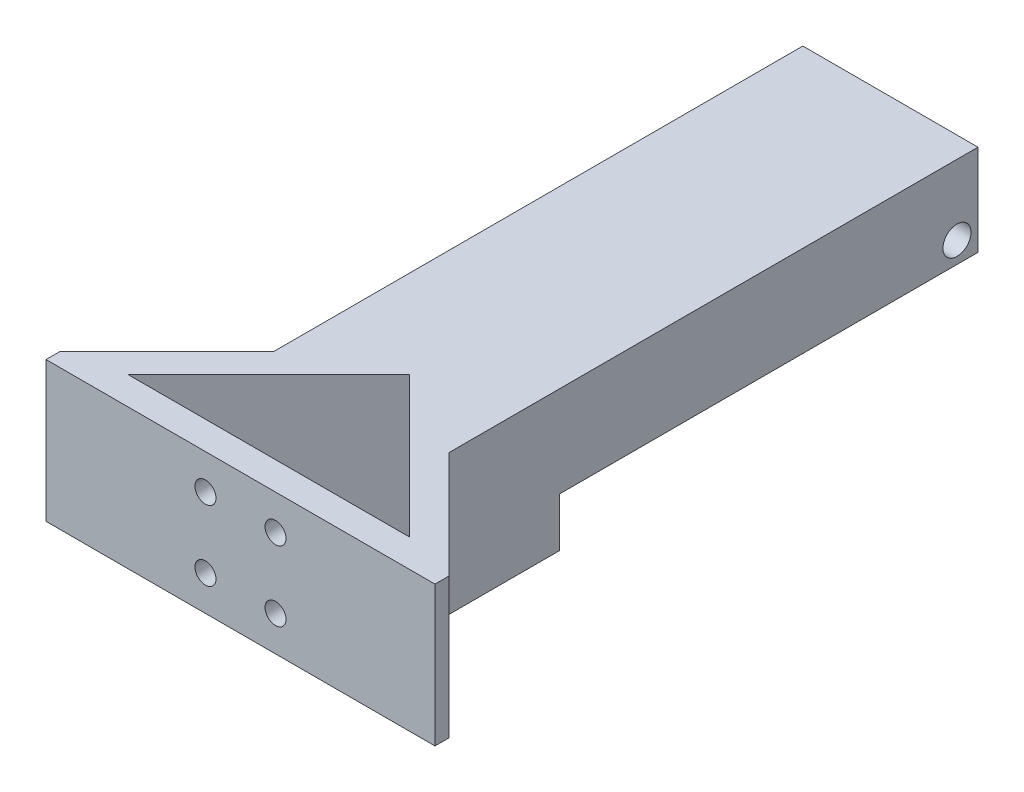
ISO-10303-21;
HEADER;
FILE_DESCRIPTION(('STEP AP214'),'2;1');
FILE_NAME('part.step','',(''),(''),'','','');
FILE_SCHEMA(('AUTOMOTIVE_DESIGN { 1 0 10303 214 1 1 1 1 }'));
ENDSEC;
DATA;
#1=APPLICATION_CONTEXT('core data for automotive mechanical design processes');
#2=APPLICATION_PROTOCOL_DEFINITION('international standard','automotive_design',2000,#1);
#3=PRODUCT_CONTEXT('',#1,'mechanical');
#4=PRODUCT('Part','Part','',(#3));
#5=PRODUCT_RELATED_PRODUCT_CATEGORY('part','',(#4));
#6=PRODUCT_DEFINITION_FORMATION('','',#4);
#7=PRODUCT_DEFINITION_CONTEXT('part definition',#1,'design');
#8=PRODUCT_DEFINITION('design','',#6,#7);
#9=PRODUCT_DEFINITION_SHAPE('','',#8);
#10=(LENGTH_UNIT() NAMED_UNIT(*) SI_UNIT(.MILLI.,.METRE.));
#11=(NAMED_UNIT(*) PLANE_ANGLE_UNIT() SI_UNIT($,.RADIAN.));
#12=(NAMED_UNIT(*) SI_UNIT($,.STERADIAN.) SOLID_ANGLE_UNIT());
#13=UNCERTAINTY_MEASURE_WITH_UNIT(LENGTH_MEASURE(1.E-05),#10,'distance_accuracy_value','');
#14=(GEOMETRIC_REPRESENTATION_CONTEXT(3) GLOBAL_UNCERTAINTY_ASSIGNED_CONTEXT((#13)) GLOBAL_UNIT_ASSIGNED_CONTEXT((#10,
#11,#12)) REPRESENTATION_CONTEXT('',''));
#15=CARTESIAN_POINT('',(0.,0.,0.));
#16=DIRECTION('',(0.,0.,1.));
#17=DIRECTION('',(1.,0.,0.));
#18=AXIS2_PLACEMENT_3D('',#15,#16,#17);
#19=CARTESIAN_POINT('',(40.2477067298061,20.,-92.7322932701938));
#20=DIRECTION('',(0.,0.,1.));
#21=DIRECTION('',(1.,0.,0.));
#22=AXIS2_PLACEMENT_3D('',#19,#20,#21);
#23=PLANE('',#22);
#24=DIRECTION('',(1.,0.,0.));
#25=VECTOR('',#24,1.);
#26=CARTESIAN_POINT('',(40.2477067298061,7.,-92.7322932701938));
#27=LINE('',#26,#25);
#28=CARTESIAN_POINT('',(15.2522932701938,7.,-92.7322932701938));
#29=VERTEX_POINT('',#28);
#30=CARTESIAN_POINT('',(40.2477067298061,7.,-92.7322932701938));
#31=VERTEX_POINT('',#30);
#32=EDGE_CURVE('E130',#29,#31,#27,.T.);
#33=ORIENTED_EDGE('',*,*,#32,.F.);
#34=DIRECTION('',(0.,-1.,0.));
#35=VECTOR('',#34,1.);
#36=CARTESIAN_POINT('',(15.2522932701938,20.,-92.7322932701938));
#37=LINE('',#36,#35);
#38=CARTESIAN_POINT('',(15.2522932701938,20.,-92.7322932701938));
#39=VERTEX_POINT('',#38);
#40=EDGE_CURVE('E228',#39,#29,#37,.T.);
#41=ORIENTED_EDGE('',*,*,#40,.F.);
#42=DIRECTION('',(-1.,0.,0.));
#43=VECTOR('',#42,1.);
#44=CARTESIAN_POINT('',(40.2477067298061,20.,-92.7322932701938));
#45=LINE('',#44,#43);
#46=CARTESIAN_POINT('',(40.2477067298061,20.,-92.7322932701938));
#47=VERTEX_POINT('',#46);
#48=EDGE_CURVE('E199',#47,#39,#45,.T.);
#49=ORIENTED_EDGE('',*,*,#48,.F.);
#50=DIRECTION('',(0.,-1.,0.));
#51=VECTOR('',#50,1.);
#52=CARTESIAN_POINT('',(40.2477067298061,20.,-92.7322932701938));
#53=LINE('',#52,#51);
#54=EDGE_CURVE('E231',#47,#31,#53,.T.);
#55=ORIENTED_EDGE('',*,*,#54,.T.);
#56=EDGE_LOOP('',(#33,#41,#49,#55));
#57=FACE_BOUND('',#56,.T.);
#58=ADVANCED_FACE('F32',(#57),#23,.F.);
#59=CARTESIAN_POINT('',(0.,20.,0.));
#60=DIRECTION('',(0.,1.,0.));
#61=DIRECTION('',(0.,0.,1.));
#62=AXIS2_PLACEMENT_3D('',#59,#60,#61);
#63=PLANE('',#62);
#64=DIRECTION('',(1.,0.,0.));
#65=VECTOR('',#64,1.);
#66=CARTESIAN_POINT('',(55.5,20.,0.));
#67=LINE('',#66,#65);
#68=CARTESIAN_POINT('',(0.,20.,0.));
#69=VERTEX_POINT('',#68);
#70=CARTESIAN_POINT('',(55.5,20.,0.));
#71=VERTEX_POINT('',#70);
#72=EDGE_CURVE('E189',#69,#71,#67,.T.);
#73=ORIENTED_EDGE('',*,*,#72,.T.);
#74=DIRECTION('',(0.,0.,-1.));
#75=VECTOR('',#74,1.);
#76=CARTESIAN_POINT('',(55.5,20.,-2.));
#77=LINE('',#76,#75);
#78=CARTESIAN_POINT('',(55.5,20.,-2.));
#79=VERTEX_POINT('',#78);
#80=EDGE_CURVE('E192',#71,#79,#77,.T.);
#81=ORIENTED_EDGE('',*,*,#80,.T.);
#82=DIRECTION('',(-0.707106781186547,0.,-0.707106781186548));
#83=VECTOR('',#82,1.);
#84=CARTESIAN_POINT('',(40.2477067298062,20.,-17.2522932701938));
#85=LINE('',#84,#83);
#86=CARTESIAN_POINT('',(40.2477067298062,20.,-17.2522932701938));
#87=VERTEX_POINT('',#86);
#88=EDGE_CURVE('E195',#79,#87,#85,.T.);
#89=ORIENTED_EDGE('',*,*,#88,.T.);
#90=DIRECTION('',(0.,0.,-1.));
#91=VECTOR('',#90,1.);
#92=CARTESIAN_POINT('',(40.2477067298061,20.,-92.7322932701938));
#93=LINE('',#92,#91);
#94=EDGE_CURVE('E197',#87,#47,#93,.T.);
#95=ORIENTED_EDGE('',*,*,#94,.T.);
#96=ORIENTED_EDGE('',*,*,#48,.T.);
#97=DIRECTION('',(0.,0.,1.));
#98=VECTOR('',#97,1.);
#99=CARTESIAN_POINT('',(15.2522932701938,20.,-92.7322932701938));
#100=LINE('',#99,#98);
#101=CARTESIAN_POINT('',(15.2522932701938,20.,-17.2522932701938));
#102=VERTEX_POINT('',#101);
#103=EDGE_CURVE('E201',#39,#102,#100,.T.);
#104=ORIENTED_EDGE('',*,*,#103,.T.);
#105=DIRECTION('',(-0.707106781186547,0.,0.707106781186548));
#106=VECTOR('',#105,1.);
#107=CARTESIAN_POINT('',(15.2522932701938,20.,-17.2522932701938));
#108=LINE('',#107,#106);
#109=CARTESIAN_POINT('',(0.,20.,-2.));
#110=VERTEX_POINT('',#109);
#111=EDGE_CURVE('E203',#102,#110,#108,.T.);
#112=ORIENTED_EDGE('',*,*,#111,.T.);
#113=DIRECTION('',(0.,0.,1.));
#114=VECTOR('',#113,1.);
#115=CARTESIAN_POINT('',(0.,20.,-2.));
#116=LINE('',#115,#114);
#117=EDGE_CURVE('E205',#110,#69,#116,.T.);
#118=ORIENTED_EDGE('',*,*,#117,.T.);
#119=EDGE_LOOP('',(#73,#81,#89,#95,#96,#104,#112,#118));
#120=FACE_BOUND('',#119,.T.);
#121=DIRECTION('',(1.,0.,0.));
#122=VECTOR('',#121,1.);
#123=CARTESIAN_POINT('',(47.8431457505076,20.,-4.));
#124=LINE('',#123,#122);
#125=CARTESIAN_POINT('',(7.65685424949238,20.,-3.99999999999999));
#126=VERTEX_POINT('',#125);
#127=CARTESIAN_POINT('',(47.8431457505076,20.,-4.));
#128=VERTEX_POINT('',#127);
#129=EDGE_CURVE('E168',#126,#128,#124,.T.);
#130=ORIENTED_EDGE('',*,*,#129,.F.);
#131=DIRECTION('',(-0.707106781186547,0.,0.707106781186548));
#132=VECTOR('',#131,1.);
#133=CARTESIAN_POINT('',(7.65685424949238,20.,-3.99999999999999));
#134=LINE('',#133,#132);
#135=CARTESIAN_POINT('',(27.75,20.,-24.0931457505076));
#136=VERTEX_POINT('',#135);
#137=EDGE_CURVE('E166',#136,#126,#134,.T.);
#138=ORIENTED_EDGE('',*,*,#137,.F.);
#139=DIRECTION('',(-0.707106781186547,0.,-0.707106781186548));
#140=VECTOR('',#139,1.);
#141=CARTESIAN_POINT('',(27.75,20.,-24.0931457505076));
#142=LINE('',#141,#140);
#143=EDGE_CURVE('E171',#128,#136,#142,.T.);
#144=ORIENTED_EDGE('',*,*,#143,.F.);
#145=EDGE_LOOP('',(#130,#138,#144));
#146=FACE_BOUND('',#145,.T.);
#147=ADVANCED_FACE('F257',(#120,#146),#63,.T.);
#148=CARTESIAN_POINT('',(0.,0.,0.));
#149=DIRECTION('',(0.,1.,0.));
#150=DIRECTION('',(0.,0.,1.));
#151=AXIS2_PLACEMENT_3D('',#148,#149,#150);
#152=PLANE('',#151);
#153=DIRECTION('',(0.,0.,1.));
#154=VECTOR('',#153,1.);
#155=CARTESIAN_POINT('',(15.2522932701938,0.,-92.7322932701938));
#156=LINE('',#155,#154);
#157=CARTESIAN_POINT('',(15.2522932701938,0.,-33.0022932701938));
#158=VERTEX_POINT('',#157);
#159=CARTESIAN_POINT('',(15.2522932701938,0.,-17.2522932701938));
#160=VERTEX_POINT('',#159);
#161=EDGE_CURVE('E215',#158,#160,#156,.T.);
#162=ORIENTED_EDGE('',*,*,#161,.F.);
#163=DIRECTION('',(-1.,0.,0.));
#164=VECTOR('',#163,1.);
#165=CARTESIAN_POINT('',(40.2477067298061,0.,-33.0022932701938));
#166=LINE('',#165,#164);
#167=CARTESIAN_POINT('',(40.2477067298061,0.,-33.0022932701938));
#168=VERTEX_POINT('',#167);
#169=EDGE_CURVE('E139',#168,#158,#166,.T.);
#170=ORIENTED_EDGE('',*,*,#169,.F.);
#171=DIRECTION('',(0.,0.,-1.));
#172=VECTOR('',#171,1.);
#173=CARTESIAN_POINT('',(40.2477067298061,0.,-92.7322932701938));
#174=LINE('',#173,#172);
#175=CARTESIAN_POINT('',(40.2477067298062,0.,-17.2522932701938));
#176=VERTEX_POINT('',#175);
#177=EDGE_CURVE('E145',#176,#168,#174,.T.);
#178=ORIENTED_EDGE('',*,*,#177,.F.);
#179=DIRECTION('',(-0.707106781186547,0.,-0.707106781186548));
#180=VECTOR('',#179,1.);
#181=CARTESIAN_POINT('',(40.2477067298062,0.,-17.2522932701938));
#182=LINE('',#181,#180);
#183=CARTESIAN_POINT('',(55.5,0.,-2.));
#184=VERTEX_POINT('',#183);
#185=EDGE_CURVE('E212',#184,#176,#182,.T.);
#186=ORIENTED_EDGE('',*,*,#185,.F.);
#187=DIRECTION('',(0.,0.,-1.));
#188=VECTOR('',#187,1.);
#189=CARTESIAN_POINT('',(55.5,0.,-2.));
#190=LINE('',#189,#188);
#191=CARTESIAN_POINT('',(55.5,0.,0.));
#192=VERTEX_POINT('',#191);
#193=EDGE_CURVE('E210',#192,#184,#190,.T.);
#194=ORIENTED_EDGE('',*,*,#193,.F.);
#195=DIRECTION('',(1.,0.,0.));
#196=VECTOR('',#195,1.);
#197=CARTESIAN_POINT('',(55.5,0.,0.));
#198=LINE('',#197,#196);
#199=CARTESIAN_POINT('',(0.,0.,0.));
#200=VERTEX_POINT('',#199);
#201=EDGE_CURVE('E188',#200,#192,#198,.T.);
#202=ORIENTED_EDGE('',*,*,#201,.F.);
#203=DIRECTION('',(0.,0.,1.));
#204=VECTOR('',#203,1.);
#205=CARTESIAN_POINT('',(0.,0.,-2.));
#206=LINE('',#205,#204);
#207=CARTESIAN_POINT('',(0.,0.,-2.));
#208=VERTEX_POINT('',#207);
#209=EDGE_CURVE('E193',#208,#200,#206,.T.);
#210=ORIENTED_EDGE('',*,*,#209,.F.);
#211=DIRECTION('',(-0.707106781186547,0.,0.707106781186548));
#212=VECTOR('',#211,1.);
#213=CARTESIAN_POINT('',(15.2522932701938,0.,-17.2522932701938));
#214=LINE('',#213,#212);
#215=EDGE_CURVE('E217',#160,#208,#214,.T.);
#216=ORIENTED_EDGE('',*,*,#215,.F.);
#217=EDGE_LOOP('',(#162,#170,#178,#186,#194,#202,#210,#216));
#218=FACE_BOUND('',#217,.T.);
#219=DIRECTION('',(-0.707106781186547,0.,0.707106781186548));
#220=VECTOR('',#219,1.);
#221=CARTESIAN_POINT('',(7.65685424949238,0.,-3.99999999999999));
#222=LINE('',#221,#220);
#223=CARTESIAN_POINT('',(27.75,0.,-24.0931457505076));
#224=VERTEX_POINT('',#223);
#225=CARTESIAN_POINT('',(7.65685424949238,0.,-3.99999999999999));
#226=VERTEX_POINT('',#225);
#227=EDGE_CURVE('E174',#224,#226,#222,.T.);
#228=ORIENTED_EDGE('',*,*,#227,.T.);
#229=DIRECTION('',(1.,0.,0.));
#230=VECTOR('',#229,1.);
#231=CARTESIAN_POINT('',(47.8431457505076,0.,-4.));
#232=LINE('',#231,#230);
#233=CARTESIAN_POINT('',(47.8431457505076,0.,-4.));
#234=VERTEX_POINT('',#233);
#235=EDGE_CURVE('E177',#226,#234,#232,.T.);
#236=ORIENTED_EDGE('',*,*,#235,.T.);
#237=DIRECTION('',(-0.707106781186547,0.,-0.707106781186548));
#238=VECTOR('',#237,1.);
#239=CARTESIAN_POINT('',(27.75,0.,-24.0931457505076));
#240=LINE('',#239,#238);
#241=EDGE_CURVE('E169',#234,#224,#240,.T.);
#242=ORIENTED_EDGE('',*,*,#241,.T.);
#243=EDGE_LOOP('',(#228,#236,#242));
#244=FACE_BOUND('',#243,.T.);
#245=ADVANCED_FACE('F267',(#218,#244),#152,.F.);
#246=CARTESIAN_POINT('',(55.5,20.,0.));
#247=DIRECTION('',(0.,0.,-1.));
#248=DIRECTION('',(-1.,0.,0.));
#249=AXIS2_PLACEMENT_3D('',#246,#247,#248);
#250=PLANE('',#249);
#251=CARTESIAN_POINT('',(22.75,5.,0.));
#252=DIRECTION('',(0.,0.,1.));
#253=DIRECTION('',(-1.,0.,0.));
#254=AXIS2_PLACEMENT_3D('',#251,#252,#253);
#255=CIRCLE('',#254,1.5);
#256=CARTESIAN_POINT('',(21.25,5.,0.));
#257=VERTEX_POINT('',#256);
#258=EDGE_CURVE('E146',#257,#257,#255,.T.);
#259=ORIENTED_EDGE('',*,*,#258,.F.);
#260=EDGE_LOOP('',(#259));
#261=FACE_BOUND('',#260,.T.);
#262=CARTESIAN_POINT('',(32.75,5.,0.));
#263=DIRECTION('',(0.,0.,1.));
#264=DIRECTION('',(1.,0.,0.));
#265=AXIS2_PLACEMENT_3D('',#262,#263,#264);
#266=CIRCLE('',#265,1.5);
#267=CARTESIAN_POINT('',(34.25,5.,0.));
#268=VERTEX_POINT('',#267);
#269=EDGE_CURVE('E154',#268,#268,#266,.T.);
#270=ORIENTED_EDGE('',*,*,#269,.F.);
#271=EDGE_LOOP('',(#270));
#272=FACE_BOUND('',#271,.T.);
#273=CARTESIAN_POINT('',(32.75,15.,0.));
#274=DIRECTION('',(0.,0.,1.));
#275=DIRECTION('',(-1.,0.,0.));
#276=AXIS2_PLACEMENT_3D('',#273,#274,#275);
#277=CIRCLE('',#276,1.5);
#278=CARTESIAN_POINT('',(31.25,15.,0.));
#279=VERTEX_POINT('',#278);
#280=EDGE_CURVE('E158',#279,#279,#277,.T.);
#281=ORIENTED_EDGE('',*,*,#280,.F.);
#282=EDGE_LOOP('',(#281));
#283=FACE_BOUND('',#282,.T.);
#284=CARTESIAN_POINT('',(22.75,15.,0.));
#285=DIRECTION('',(0.,0.,1.));
#286=DIRECTION('',(1.,0.,0.));
#287=AXIS2_PLACEMENT_3D('',#284,#285,#286);
#288=CIRCLE('',#287,1.5);
#289=CARTESIAN_POINT('',(24.25,15.,0.));
#290=VERTEX_POINT('',#289);
#291=EDGE_CURVE('E162',#290,#290,#288,.T.);
#292=ORIENTED_EDGE('',*,*,#291,.F.);
#293=EDGE_LOOP('',(#292));
#294=FACE_BOUND('',#293,.T.);
#295=ORIENTED_EDGE('',*,*,#201,.T.);
#296=DIRECTION('',(0.,-1.,0.));
#297=VECTOR('',#296,1.);
#298=CARTESIAN_POINT('',(55.5,20.,0.));
#299=LINE('',#298,#297);
#300=EDGE_CURVE('E238',#71,#192,#299,.T.);
#301=ORIENTED_EDGE('',*,*,#300,.F.);
#302=ORIENTED_EDGE('',*,*,#72,.F.);
#303=DIRECTION('',(0.,-1.,0.));
#304=VECTOR('',#303,1.);
#305=CARTESIAN_POINT('',(0.,20.,0.));
#306=LINE('',#305,#304);
#307=EDGE_CURVE('E207',#69,#200,#306,.T.);
#308=ORIENTED_EDGE('',*,*,#307,.T.);
#309=EDGE_LOOP('',(#295,#301,#302,#308));
#310=FACE_BOUND('',#309,.T.);
#311=ADVANCED_FACE('F34',(#261,#272,#283,#294,#310),#250,.F.);
#312=CARTESIAN_POINT('',(55.5,20.,-2.));
#313=DIRECTION('',(-1.,0.,0.));
#314=DIRECTION('',(0.,0.,1.));
#315=AXIS2_PLACEMENT_3D('',#312,#313,#314);
#316=PLANE('',#315);
#317=ORIENTED_EDGE('',*,*,#193,.T.);
#318=DIRECTION('',(0.,-1.,0.));
#319=VECTOR('',#318,1.);
#320=CARTESIAN_POINT('',(55.5,20.,-2.));
#321=LINE('',#320,#319);
#322=EDGE_CURVE('E235',#79,#184,#321,.T.);
#323=ORIENTED_EDGE('',*,*,#322,.F.);
#324=ORIENTED_EDGE('',*,*,#80,.F.);
#325=ORIENTED_EDGE('',*,*,#300,.T.);
#326=EDGE_LOOP('',(#317,#323,#324,#325));
#327=FACE_BOUND('',#326,.T.);
#328=ADVANCED_FACE('F303',(#327),#316,.F.);
#329=CARTESIAN_POINT('',(40.2477067298062,20.,-17.2522932701938));
#330=DIRECTION('',(-0.707106781186548,0.,0.707106781186547));
#331=DIRECTION('',(0.707106781186547,0.,0.707106781186548));
#332=AXIS2_PLACEMENT_3D('',#329,#330,#331);
#333=PLANE('',#332);
#334=ORIENTED_EDGE('',*,*,#185,.T.);
#335=DIRECTION('',(0.,-1.,0.));
#336=VECTOR('',#335,1.);
#337=CARTESIAN_POINT('',(40.2477067298062,20.,-17.2522932701938));
#338=LINE('',#337,#336);
#339=EDGE_CURVE('E233',#87,#176,#338,.T.);
#340=ORIENTED_EDGE('',*,*,#339,.F.);
#341=ORIENTED_EDGE('',*,*,#88,.F.);
#342=ORIENTED_EDGE('',*,*,#322,.T.);
#343=EDGE_LOOP('',(#334,#340,#341,#342));
#344=FACE_BOUND('',#343,.T.);
#345=ADVANCED_FACE('F293',(#344),#333,.F.);
#346=CARTESIAN_POINT('',(40.2477067298061,20.,-92.7322932701938));
#347=DIRECTION('',(-1.,0.,0.));
#348=DIRECTION('',(0.,0.,1.));
#349=AXIS2_PLACEMENT_3D('',#346,#347,#348);
#350=PLANE('',#349);
#351=CARTESIAN_POINT('',(40.2477067298061,10.,-89.7322932701938));
#352=DIRECTION('',(-1.,0.,0.));
#353=DIRECTION('',(0.,0.,1.));
#354=AXIS2_PLACEMENT_3D('',#351,#352,#353);
#355=CIRCLE('',#354,2.);
#356=CARTESIAN_POINT('',(40.2477067298061,10.,-87.7322932701938));
#357=VERTEX_POINT('',#356);
#358=EDGE_CURVE('E270',#357,#357,#355,.T.);
#359=ORIENTED_EDGE('',*,*,#358,.T.);
#360=EDGE_LOOP('',(#359));
#361=FACE_BOUND('',#360,.T.);
#362=ORIENTED_EDGE('',*,*,#177,.T.);
#363=DIRECTION('',(0.,-1.,0.));
#364=VECTOR('',#363,1.);
#365=CARTESIAN_POINT('',(40.2477067298061,7.,-33.0022932701938));
#366=LINE('',#365,#364);
#367=CARTESIAN_POINT('',(40.2477067298061,7.,-33.0022932701938));
#368=VERTEX_POINT('',#367);
#369=EDGE_CURVE('E127',#368,#168,#366,.T.);
#370=ORIENTED_EDGE('',*,*,#369,.F.);
#371=DIRECTION('',(0.,0.,1.));
#372=VECTOR('',#371,1.);
#373=CARTESIAN_POINT('',(40.2477067298061,7.,-92.7322932701938));
#374=LINE('',#373,#372);
#375=EDGE_CURVE('E131',#31,#368,#374,.T.);
#376=ORIENTED_EDGE('',*,*,#375,.F.);
#377=ORIENTED_EDGE('',*,*,#54,.F.);
#378=ORIENTED_EDGE('',*,*,#94,.F.);
#379=ORIENTED_EDGE('',*,*,#339,.T.);
#380=EDGE_LOOP('',(#362,#370,#376,#377,#378,#379));
#381=FACE_BOUND('',#380,.T.);
#382=ADVANCED_FACE('F142',(#361,#381),#350,.F.);
#383=CARTESIAN_POINT('',(15.2522932701938,20.,-92.7322932701938));
#384=DIRECTION('',(1.,0.,0.));
#385=DIRECTION('',(0.,0.,-1.));
#386=AXIS2_PLACEMENT_3D('',#383,#384,#385);
#387=PLANE('',#386);
#388=CARTESIAN_POINT('',(15.2522932701938,10.,-89.7322932701938));
#389=DIRECTION('',(-1.,0.,0.));
#390=DIRECTION('',(0.,0.,1.));
#391=AXIS2_PLACEMENT_3D('',#388,#389,#390);
#392=CIRCLE('',#391,2.);
#393=CARTESIAN_POINT('',(15.2522932701938,10.,-87.7322932701938));
#394=VERTEX_POINT('',#393);
#395=EDGE_CURVE('E272',#394,#394,#392,.T.);
#396=ORIENTED_EDGE('',*,*,#395,.F.);
#397=EDGE_LOOP('',(#396));
#398=FACE_BOUND('',#397,.T.);
#399=DIRECTION('',(0.,0.,-1.));
#400=VECTOR('',#399,1.);
#401=CARTESIAN_POINT('',(15.2522932701938,7.,-92.7322932701938));
#402=LINE('',#401,#400);
#403=CARTESIAN_POINT('',(15.2522932701938,7.,-33.0022932701938));
#404=VERTEX_POINT('',#403);
#405=EDGE_CURVE('E40',#404,#29,#402,.T.);
#406=ORIENTED_EDGE('',*,*,#405,.F.);
#407=DIRECTION('',(0.,-1.,0.));
#408=VECTOR('',#407,1.);
#409=CARTESIAN_POINT('',(15.2522932701938,20.,-33.0022932701938));
#410=LINE('',#409,#408);
#411=EDGE_CURVE('E11',#404,#158,#410,.T.);
#412=ORIENTED_EDGE('',*,*,#411,.T.);
#413=ORIENTED_EDGE('',*,*,#161,.T.);
#414=DIRECTION('',(0.,-1.,0.));
#415=VECTOR('',#414,1.);
#416=CARTESIAN_POINT('',(15.2522932701938,20.,-17.2522932701938));
#417=LINE('',#416,#415);
#418=EDGE_CURVE('E225',#102,#160,#417,.T.);
#419=ORIENTED_EDGE('',*,*,#418,.F.);
#420=ORIENTED_EDGE('',*,*,#103,.F.);
#421=ORIENTED_EDGE('',*,*,#40,.T.);
#422=EDGE_LOOP('',(#406,#412,#413,#419,#420,#421));
#423=FACE_BOUND('',#422,.T.);
#424=ADVANCED_FACE('F253',(#398,#423),#387,.F.);
#425=CARTESIAN_POINT('',(15.2522932701938,20.,-17.2522932701938));
#426=DIRECTION('',(0.707106781186548,0.,0.707106781186547));
#427=DIRECTION('',(0.707106781186547,0.,-0.707106781186548));
#428=AXIS2_PLACEMENT_3D('',#425,#426,#427);
#429=PLANE('',#428);
#430=ORIENTED_EDGE('',*,*,#215,.T.);
#431=DIRECTION('',(0.,-1.,0.));
#432=VECTOR('',#431,1.);
#433=CARTESIAN_POINT('',(0.,20.,-2.));
#434=LINE('',#433,#432);
#435=EDGE_CURVE('E222',#110,#208,#434,.T.);
#436=ORIENTED_EDGE('',*,*,#435,.F.);
#437=ORIENTED_EDGE('',*,*,#111,.F.);
#438=ORIENTED_EDGE('',*,*,#418,.T.);
#439=EDGE_LOOP('',(#430,#436,#437,#438));
#440=FACE_BOUND('',#439,.T.);
#441=ADVANCED_FACE('F284',(#440),#429,.F.);
#442=CARTESIAN_POINT('',(0.,20.,-2.));
#443=DIRECTION('',(1.,0.,0.));
#444=DIRECTION('',(0.,0.,-1.));
#445=AXIS2_PLACEMENT_3D('',#442,#443,#444);
#446=PLANE('',#445);
#447=ORIENTED_EDGE('',*,*,#209,.T.);
#448=ORIENTED_EDGE('',*,*,#307,.F.);
#449=ORIENTED_EDGE('',*,*,#117,.F.);
#450=ORIENTED_EDGE('',*,*,#435,.T.);
#451=EDGE_LOOP('',(#447,#448,#449,#450));
#452=FACE_BOUND('',#451,.T.);
#453=ADVANCED_FACE('F290',(#452),#446,.F.);
#454=CARTESIAN_POINT('',(7.65685424949238,20.,-3.99999999999999));
#455=DIRECTION('',(0.707106781186548,0.,0.707106781186547));
#456=DIRECTION('',(0.707106781186547,0.,-0.707106781186548));
#457=AXIS2_PLACEMENT_3D('',#454,#455,#456);
#458=PLANE('',#457);
#459=ORIENTED_EDGE('',*,*,#227,.F.);
#460=DIRECTION('',(0.,-1.,0.));
#461=VECTOR('',#460,1.);
#462=CARTESIAN_POINT('',(27.75,20.,-24.0931457505076));
#463=LINE('',#462,#461);
#464=EDGE_CURVE('E173',#136,#224,#463,.T.);
#465=ORIENTED_EDGE('',*,*,#464,.F.);
#466=ORIENTED_EDGE('',*,*,#137,.T.);
#467=DIRECTION('',(0.,-1.,0.));
#468=VECTOR('',#467,1.);
#469=CARTESIAN_POINT('',(7.65685424949238,20.,-3.99999999999999));
#470=LINE('',#469,#468);
#471=EDGE_CURVE('E185',#126,#226,#470,.T.);
#472=ORIENTED_EDGE('',*,*,#471,.T.);
#473=EDGE_LOOP('',(#459,#465,#466,#472));
#474=FACE_BOUND('',#473,.T.);
#475=ADVANCED_FACE('F320',(#474),#458,.T.);
#476=CARTESIAN_POINT('',(47.8431457505076,20.,-4.));
#477=DIRECTION('',(0.,0.,-1.));
#478=DIRECTION('',(-1.,0.,0.));
#479=AXIS2_PLACEMENT_3D('',#476,#477,#478);
#480=PLANE('',#479);
#481=CARTESIAN_POINT('',(22.75,5.,-4.));
#482=DIRECTION('',(0.,0.,-1.));
#483=DIRECTION('',(-1.,0.,0.));
#484=AXIS2_PLACEMENT_3D('',#481,#482,#483);
#485=CIRCLE('',#484,1.5);
#486=CARTESIAN_POINT('',(21.25,5.,-4.));
#487=VERTEX_POINT('',#486);
#488=EDGE_CURVE('E149',#487,#487,#485,.T.);
#489=ORIENTED_EDGE('',*,*,#488,.F.);
#490=EDGE_LOOP('',(#489));
#491=FACE_BOUND('',#490,.T.);
#492=CARTESIAN_POINT('',(32.75,5.,-4.));
#493=DIRECTION('',(0.,0.,-1.));
#494=DIRECTION('',(-1.,0.,0.));
#495=AXIS2_PLACEMENT_3D('',#492,#493,#494);
#496=CIRCLE('',#495,1.5);
#497=CARTESIAN_POINT('',(31.25,5.,-4.));
#498=VERTEX_POINT('',#497);
#499=EDGE_CURVE('E157',#498,#498,#496,.T.);
#500=ORIENTED_EDGE('',*,*,#499,.F.);
#501=EDGE_LOOP('',(#500));
#502=FACE_BOUND('',#501,.T.);
#503=CARTESIAN_POINT('',(32.75,15.,-4.));
#504=DIRECTION('',(0.,0.,-1.));
#505=DIRECTION('',(-1.,0.,0.));
#506=AXIS2_PLACEMENT_3D('',#503,#504,#505);
#507=CIRCLE('',#506,1.5);
#508=CARTESIAN_POINT('',(31.25,15.,-4.));
#509=VERTEX_POINT('',#508);
#510=EDGE_CURVE('E161',#509,#509,#507,.T.);
#511=ORIENTED_EDGE('',*,*,#510,.F.);
#512=EDGE_LOOP('',(#511));
#513=FACE_BOUND('',#512,.T.);
#514=CARTESIAN_POINT('',(22.75,15.,-4.));
#515=DIRECTION('',(0.,0.,-1.));
#516=DIRECTION('',(-1.,0.,0.));
#517=AXIS2_PLACEMENT_3D('',#514,#515,#516);
#518=CIRCLE('',#517,1.5);
#519=CARTESIAN_POINT('',(21.25,15.,-4.));
#520=VERTEX_POINT('',#519);
#521=EDGE_CURVE('E165',#520,#520,#518,.T.);
#522=ORIENTED_EDGE('',*,*,#521,.F.);
#523=EDGE_LOOP('',(#522));
#524=FACE_BOUND('',#523,.T.);
#525=ORIENTED_EDGE('',*,*,#235,.F.);
#526=ORIENTED_EDGE('',*,*,#471,.F.);
#527=ORIENTED_EDGE('',*,*,#129,.T.);
#528=DIRECTION('',(0.,-1.,0.));
#529=VECTOR('',#528,1.);
#530=CARTESIAN_POINT('',(47.8431457505076,20.,-4.));
#531=LINE('',#530,#529);
#532=EDGE_CURVE('E55',#128,#234,#531,.T.);
#533=ORIENTED_EDGE('',*,*,#532,.T.);
#534=EDGE_LOOP('',(#525,#526,#527,#533));
#535=FACE_BOUND('',#534,.T.);
#536=ADVANCED_FACE('F325',(#491,#502,#513,#524,#535),#480,.T.);
#537=CARTESIAN_POINT('',(27.75,20.,-24.0931457505076));
#538=DIRECTION('',(-0.707106781186548,0.,0.707106781186547));
#539=DIRECTION('',(0.707106781186547,0.,0.707106781186548));
#540=AXIS2_PLACEMENT_3D('',#537,#538,#539);
#541=PLANE('',#540);
#542=ORIENTED_EDGE('',*,*,#241,.F.);
#543=ORIENTED_EDGE('',*,*,#532,.F.);
#544=ORIENTED_EDGE('',*,*,#143,.T.);
#545=ORIENTED_EDGE('',*,*,#464,.T.);
#546=EDGE_LOOP('',(#542,#543,#544,#545));
#547=FACE_BOUND('',#546,.T.);
#548=ADVANCED_FACE('F333',(#547),#541,.T.);
#549=CARTESIAN_POINT('',(22.75,15.,-5.));
#550=DIRECTION('',(0.,0.,1.));
#551=DIRECTION('',(1.,0.,0.));
#552=AXIS2_PLACEMENT_3D('',#549,#550,#551);
#553=CYLINDRICAL_SURFACE('',#552,1.5);
#554=ORIENTED_EDGE('',*,*,#521,.T.);
#555=EDGE_LOOP('',(#554));
#556=FACE_BOUND('',#555,.T.);
#557=ORIENTED_EDGE('',*,*,#291,.T.);
#558=EDGE_LOOP('',(#557));
#559=FACE_BOUND('',#558,.T.);
#560=ADVANCED_FACE('F337',(#556,#559),#553,.F.);
#561=CARTESIAN_POINT('',(32.75,15.,-5.));
#562=DIRECTION('',(0.,0.,1.));
#563=DIRECTION('',(1.,0.,0.));
#564=AXIS2_PLACEMENT_3D('',#561,#562,#563);
#565=CYLINDRICAL_SURFACE('',#564,1.5);
#566=ORIENTED_EDGE('',*,*,#510,.T.);
#567=EDGE_LOOP('',(#566));
#568=FACE_BOUND('',#567,.T.);
#569=ORIENTED_EDGE('',*,*,#280,.T.);
#570=EDGE_LOOP('',(#569));
#571=FACE_BOUND('',#570,.T.);
#572=ADVANCED_FACE('F340',(#568,#571),#565,.F.);
#573=CARTESIAN_POINT('',(32.75,5.,-5.));
#574=DIRECTION('',(0.,0.,1.));
#575=DIRECTION('',(1.,0.,0.));
#576=AXIS2_PLACEMENT_3D('',#573,#574,#575);
#577=CYLINDRICAL_SURFACE('',#576,1.5);
#578=ORIENTED_EDGE('',*,*,#499,.T.);
#579=EDGE_LOOP('',(#578));
#580=FACE_BOUND('',#579,.T.);
#581=ORIENTED_EDGE('',*,*,#269,.T.);
#582=EDGE_LOOP('',(#581));
#583=FACE_BOUND('',#582,.T.);
#584=ADVANCED_FACE('F344',(#580,#583),#577,.F.);
#585=CARTESIAN_POINT('',(22.75,5.,-5.));
#586=DIRECTION('',(0.,0.,1.));
#587=DIRECTION('',(1.,0.,0.));
#588=AXIS2_PLACEMENT_3D('',#585,#586,#587);
#589=CYLINDRICAL_SURFACE('',#588,1.5);
#590=ORIENTED_EDGE('',*,*,#488,.T.);
#591=EDGE_LOOP('',(#590));
#592=FACE_BOUND('',#591,.T.);
#593=ORIENTED_EDGE('',*,*,#258,.T.);
#594=EDGE_LOOP('',(#593));
#595=FACE_BOUND('',#594,.T.);
#596=ADVANCED_FACE('F348',(#592,#595),#589,.F.);
#597=CARTESIAN_POINT('',(40.2477067298061,7.,-33.0022932701938));
#598=DIRECTION('',(0.,0.,1.));
#599=DIRECTION('',(1.,0.,0.));
#600=AXIS2_PLACEMENT_3D('',#597,#598,#599);
#601=PLANE('',#600);
#602=DIRECTION('',(-1.,0.,0.));
#603=VECTOR('',#602,1.);
#604=CARTESIAN_POINT('',(40.2477067298061,7.,-33.0022932701938));
#605=LINE('',#604,#603);
#606=EDGE_CURVE('E47',#368,#404,#605,.T.);
#607=ORIENTED_EDGE('',*,*,#606,.F.);
#608=ORIENTED_EDGE('',*,*,#369,.T.);
#609=ORIENTED_EDGE('',*,*,#169,.T.);
#610=ORIENTED_EDGE('',*,*,#411,.F.);
#611=EDGE_LOOP('',(#607,#608,#609,#610));
#612=FACE_BOUND('',#611,.T.);
#613=ADVANCED_FACE('F125',(#612),#601,.F.);
#614=CARTESIAN_POINT('',(0.,7.,0.));
#615=DIRECTION('',(0.,-1.,0.));
#616=DIRECTION('',(0.,0.,-1.));
#617=AXIS2_PLACEMENT_3D('',#614,#615,#616);
#618=PLANE('',#617);
#619=ORIENTED_EDGE('',*,*,#405,.T.);
#620=ORIENTED_EDGE('',*,*,#32,.T.);
#621=ORIENTED_EDGE('',*,*,#375,.T.);
#622=ORIENTED_EDGE('',*,*,#606,.T.);
#623=EDGE_LOOP('',(#619,#620,#621,#622));
#624=FACE_BOUND('',#623,.T.);
#625=ADVANCED_FACE('F134',(#624),#618,.T.);
#626=CARTESIAN_POINT('',(55.5,10.,-89.7322932701938));
#627=DIRECTION('',(-1.,0.,0.));
#628=DIRECTION('',(0.,0.,1.));
#629=AXIS2_PLACEMENT_3D('',#626,#627,#628);
#630=CYLINDRICAL_SURFACE('',#629,2.);
#631=ORIENTED_EDGE('',*,*,#395,.T.);
#632=EDGE_LOOP('',(#631));
#633=FACE_BOUND('',#632,.T.);
#634=ORIENTED_EDGE('',*,*,#358,.F.);
#635=EDGE_LOOP('',(#634));
#636=FACE_BOUND('',#635,.T.);
#637=ADVANCED_FACE('F280',(#633,#636),#630,.F.);
#638=CLOSED_SHELL('',(#58,#147,#245,#311,#328,#345,#382,#424,#441,#453,#475,#536,#548,#560,#572,
#584,#596,#613,#625,#637));
#639=MANIFOLD_SOLID_BREP('B2',#638);
#640=ADVANCED_BREP_SHAPE_REPRESENTATION('',(#18,#639),#14);
#641=SHAPE_DEFINITION_REPRESENTATION(#9,#640);
ENDSEC;
END-ISO-10303-21;
